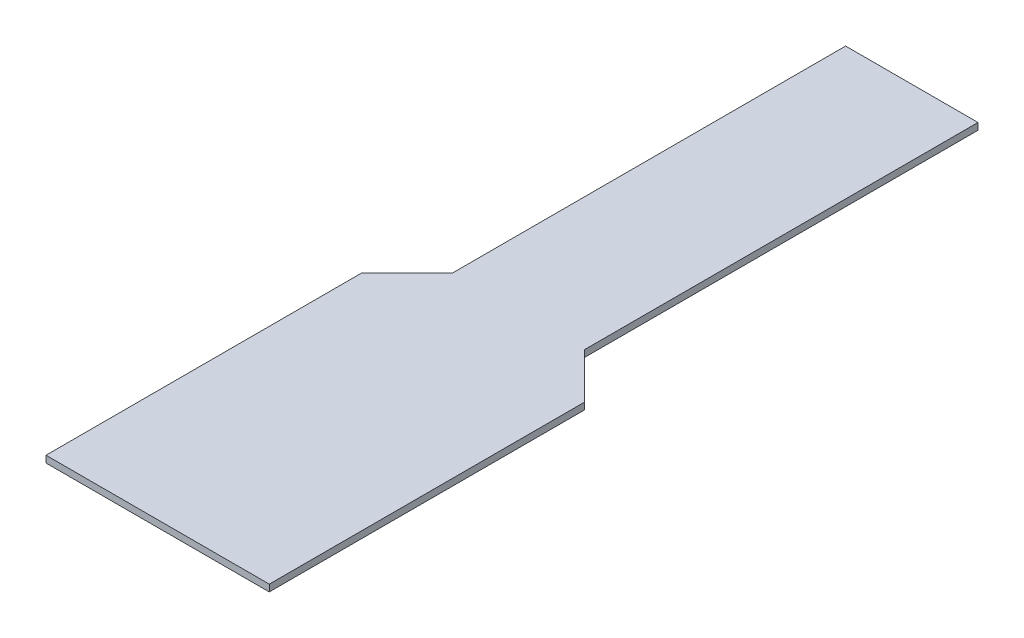
ISO-10303-21;
HEADER;
FILE_DESCRIPTION(('STEP AP214'),'2;1');
FILE_NAME('part.step','',(''),(''),'','','');
FILE_SCHEMA(('AUTOMOTIVE_DESIGN { 1 0 10303 214 1 1 1 1 }'));
ENDSEC;
DATA;
#1=APPLICATION_CONTEXT('core data for automotive mechanical design processes');
#2=APPLICATION_PROTOCOL_DEFINITION('international standard','automotive_design',2000,#1);
#3=PRODUCT_CONTEXT('',#1,'mechanical');
#4=PRODUCT('Part','Part','',(#3));
#5=PRODUCT_RELATED_PRODUCT_CATEGORY('part','',(#4));
#6=PRODUCT_DEFINITION_FORMATION('','',#4);
#7=PRODUCT_DEFINITION_CONTEXT('part definition',#1,'design');
#8=PRODUCT_DEFINITION('design','',#6,#7);
#9=PRODUCT_DEFINITION_SHAPE('','',#8);
#10=(LENGTH_UNIT() NAMED_UNIT(*) SI_UNIT(.MILLI.,.METRE.));
#11=(NAMED_UNIT(*) PLANE_ANGLE_UNIT() SI_UNIT($,.RADIAN.));
#12=(NAMED_UNIT(*) SI_UNIT($,.STERADIAN.) SOLID_ANGLE_UNIT());
#13=UNCERTAINTY_MEASURE_WITH_UNIT(LENGTH_MEASURE(1.E-05),#10,'distance_accuracy_value','');
#14=(GEOMETRIC_REPRESENTATION_CONTEXT(3) GLOBAL_UNCERTAINTY_ASSIGNED_CONTEXT((#13)) GLOBAL_UNIT_ASSIGNED_CONTEXT((#10,
#11,#12)) REPRESENTATION_CONTEXT('',''));
#15=CARTESIAN_POINT('',(0.,0.,0.));
#16=DIRECTION('',(0.,0.,1.));
#17=DIRECTION('',(1.,0.,0.));
#18=AXIS2_PLACEMENT_3D('',#15,#16,#17);
#19=CARTESIAN_POINT('',(-10.4521,0.635,41.0845));
#20=DIRECTION('',(1.,0.,0.));
#21=DIRECTION('',(0.,0.,-1.));
#22=AXIS2_PLACEMENT_3D('',#19,#20,#21);
#23=PLANE('',#22);
#24=DIRECTION('',(0.,0.,1.));
#25=VECTOR('',#24,1.);
#26=CARTESIAN_POINT('',(-10.4521,0.,41.0845));
#27=LINE('',#26,#25);
#28=CARTESIAN_POINT('',(-10.4521,0.,41.0845));
#29=VERTEX_POINT('',#28);
#30=CARTESIAN_POINT('',(-10.4521,0.,70.612));
#31=VERTEX_POINT('',#30);
#32=EDGE_CURVE('E128',#29,#31,#27,.T.);
#33=ORIENTED_EDGE('',*,*,#32,.T.);
#34=DIRECTION('',(0.,-1.,0.));
#35=VECTOR('',#34,1.);
#36=CARTESIAN_POINT('',(-10.4521,0.635,70.612));
#37=LINE('',#36,#35);
#38=CARTESIAN_POINT('',(-10.4521,0.635,70.612));
#39=VERTEX_POINT('',#38);
#40=EDGE_CURVE('E11',#39,#31,#37,.T.);
#41=ORIENTED_EDGE('',*,*,#40,.F.);
#42=DIRECTION('',(0.,0.,1.));
#43=VECTOR('',#42,1.);
#44=CARTESIAN_POINT('',(-10.4521,0.635,41.0845));
#45=LINE('',#44,#43);
#46=CARTESIAN_POINT('',(-10.4521,0.635,41.0845));
#47=VERTEX_POINT('',#46);
#48=EDGE_CURVE('E142',#47,#39,#45,.T.);
#49=ORIENTED_EDGE('',*,*,#48,.F.);
#50=DIRECTION('',(0.,-1.,0.));
#51=VECTOR('',#50,1.);
#52=CARTESIAN_POINT('',(-10.4521,0.635,41.0845));
#53=LINE('',#52,#51);
#54=EDGE_CURVE('E124',#47,#29,#53,.T.);
#55=ORIENTED_EDGE('',*,*,#54,.T.);
#56=EDGE_LOOP('',(#33,#41,#49,#55));
#57=FACE_BOUND('',#56,.T.);
#58=ADVANCED_FACE('F32',(#57),#23,.F.);
#59=CARTESIAN_POINT('',(10.4521,0.635,70.612));
#60=DIRECTION('',(0.,0.,-1.));
#61=DIRECTION('',(-1.,0.,0.));
#62=AXIS2_PLACEMENT_3D('',#59,#60,#61);
#63=PLANE('',#62);
#64=DIRECTION('',(1.,0.,0.));
#65=VECTOR('',#64,1.);
#66=CARTESIAN_POINT('',(10.4521,0.,70.612));
#67=LINE('',#66,#65);
#68=CARTESIAN_POINT('',(10.4521,0.,70.612));
#69=VERTEX_POINT('',#68);
#70=EDGE_CURVE('E131',#31,#69,#67,.T.);
#71=ORIENTED_EDGE('',*,*,#70,.T.);
#72=DIRECTION('',(0.,-1.,0.));
#73=VECTOR('',#72,1.);
#74=CARTESIAN_POINT('',(10.4521,0.635,70.612));
#75=LINE('',#74,#73);
#76=CARTESIAN_POINT('',(10.4521,0.635,70.612));
#77=VERTEX_POINT('',#76);
#78=EDGE_CURVE('E40',#77,#69,#75,.T.);
#79=ORIENTED_EDGE('',*,*,#78,.F.);
#80=DIRECTION('',(1.,0.,0.));
#81=VECTOR('',#80,1.);
#82=CARTESIAN_POINT('',(10.4521,0.635,70.612));
#83=LINE('',#82,#81);
#84=EDGE_CURVE('E91',#39,#77,#83,.T.);
#85=ORIENTED_EDGE('',*,*,#84,.F.);
#86=ORIENTED_EDGE('',*,*,#40,.T.);
#87=EDGE_LOOP('',(#71,#79,#85,#86));
#88=FACE_BOUND('',#87,.T.);
#89=ADVANCED_FACE('F177',(#88),#63,.F.);
#90=CARTESIAN_POINT('',(10.4521,0.635,41.0845));
#91=DIRECTION('',(-1.,0.,0.));
#92=DIRECTION('',(0.,0.,1.));
#93=AXIS2_PLACEMENT_3D('',#90,#91,#92);
#94=PLANE('',#93);
#95=DIRECTION('',(0.,0.,-1.));
#96=VECTOR('',#95,1.);
#97=CARTESIAN_POINT('',(10.4521,0.,41.0845));
#98=LINE('',#97,#96);
#99=CARTESIAN_POINT('',(10.4521,0.,41.0845));
#100=VERTEX_POINT('',#99);
#101=EDGE_CURVE('E133',#69,#100,#98,.T.);
#102=ORIENTED_EDGE('',*,*,#101,.T.);
#103=DIRECTION('',(0.,-1.,0.));
#104=VECTOR('',#103,1.);
#105=CARTESIAN_POINT('',(10.4521,0.635,41.0845));
#106=LINE('',#105,#104);
#107=CARTESIAN_POINT('',(10.4521,0.635,41.0845));
#108=VERTEX_POINT('',#107);
#109=EDGE_CURVE('E149',#108,#100,#106,.T.);
#110=ORIENTED_EDGE('',*,*,#109,.F.);
#111=DIRECTION('',(0.,0.,-1.));
#112=VECTOR('',#111,1.);
#113=CARTESIAN_POINT('',(10.4521,0.635,41.0845));
#114=LINE('',#113,#112);
#115=EDGE_CURVE('E157',#77,#108,#114,.T.);
#116=ORIENTED_EDGE('',*,*,#115,.F.);
#117=ORIENTED_EDGE('',*,*,#78,.T.);
#118=EDGE_LOOP('',(#102,#110,#116,#117));
#119=FACE_BOUND('',#118,.T.);
#120=ADVANCED_FACE('F155',(#119),#94,.F.);
#121=CARTESIAN_POINT('',(6.1976,0.635,36.83));
#122=DIRECTION('',(-0.707106781186546,0.,0.707106781186549));
#123=DIRECTION('',(0.707106781186549,0.,0.707106781186546));
#124=AXIS2_PLACEMENT_3D('',#121,#122,#123);
#125=PLANE('',#124);
#126=DIRECTION('',(-0.707106781186549,0.,-0.707106781186546));
#127=VECTOR('',#126,1.);
#128=CARTESIAN_POINT('',(6.1976,0.,36.83));
#129=LINE('',#128,#127);
#130=CARTESIAN_POINT('',(6.1976,0.,36.83));
#131=VERTEX_POINT('',#130);
#132=EDGE_CURVE('E135',#100,#131,#129,.T.);
#133=ORIENTED_EDGE('',*,*,#132,.T.);
#134=DIRECTION('',(0.,-1.,0.));
#135=VECTOR('',#134,1.);
#136=CARTESIAN_POINT('',(6.1976,0.635,36.83));
#137=LINE('',#136,#135);
#138=CARTESIAN_POINT('',(6.1976,0.635,36.83));
#139=VERTEX_POINT('',#138);
#140=EDGE_CURVE('E146',#139,#131,#137,.T.);
#141=ORIENTED_EDGE('',*,*,#140,.F.);
#142=DIRECTION('',(-0.707106781186549,0.,-0.707106781186546));
#143=VECTOR('',#142,1.);
#144=CARTESIAN_POINT('',(6.1976,0.635,36.83));
#145=LINE('',#144,#143);
#146=EDGE_CURVE('E169',#108,#139,#145,.T.);
#147=ORIENTED_EDGE('',*,*,#146,.F.);
#148=ORIENTED_EDGE('',*,*,#109,.T.);
#149=EDGE_LOOP('',(#133,#141,#147,#148));
#150=FACE_BOUND('',#149,.T.);
#151=ADVANCED_FACE('F165',(#150),#125,.F.);
#152=CARTESIAN_POINT('',(6.1976,0.635,0.));
#153=DIRECTION('',(-1.,0.,0.));
#154=DIRECTION('',(0.,0.,1.));
#155=AXIS2_PLACEMENT_3D('',#152,#153,#154);
#156=PLANE('',#155);
#157=DIRECTION('',(0.,0.,-1.));
#158=VECTOR('',#157,1.);
#159=CARTESIAN_POINT('',(6.1976,0.,0.));
#160=LINE('',#159,#158);
#161=CARTESIAN_POINT('',(6.1976,0.,0.));
#162=VERTEX_POINT('',#161);
#163=EDGE_CURVE('E137',#131,#162,#160,.T.);
#164=ORIENTED_EDGE('',*,*,#163,.T.);
#165=DIRECTION('',(0.,-1.,0.));
#166=VECTOR('',#165,1.);
#167=CARTESIAN_POINT('',(6.1976,0.635,0.));
#168=LINE('',#167,#166);
#169=CARTESIAN_POINT('',(6.1976,0.635,0.));
#170=VERTEX_POINT('',#169);
#171=EDGE_CURVE('E119',#170,#162,#168,.T.);
#172=ORIENTED_EDGE('',*,*,#171,.F.);
#173=DIRECTION('',(0.,0.,-1.));
#174=VECTOR('',#173,1.);
#175=CARTESIAN_POINT('',(6.1976,0.635,0.));
#176=LINE('',#175,#174);
#177=EDGE_CURVE('E110',#139,#170,#176,.T.);
#178=ORIENTED_EDGE('',*,*,#177,.F.);
#179=ORIENTED_EDGE('',*,*,#140,.T.);
#180=EDGE_LOOP('',(#164,#172,#178,#179));
#181=FACE_BOUND('',#180,.T.);
#182=ADVANCED_FACE('F168',(#181),#156,.F.);
#183=CARTESIAN_POINT('',(-6.1976,0.635,0.));
#184=DIRECTION('',(0.,0.,1.));
#185=DIRECTION('',(1.,0.,0.));
#186=AXIS2_PLACEMENT_3D('',#183,#184,#185);
#187=PLANE('',#186);
#188=DIRECTION('',(-1.,0.,0.));
#189=VECTOR('',#188,1.);
#190=CARTESIAN_POINT('',(-6.1976,0.,0.));
#191=LINE('',#190,#189);
#192=CARTESIAN_POINT('',(-6.1976,0.,0.));
#193=VERTEX_POINT('',#192);
#194=EDGE_CURVE('E118',#162,#193,#191,.T.);
#195=ORIENTED_EDGE('',*,*,#194,.T.);
#196=DIRECTION('',(0.,-1.,0.));
#197=VECTOR('',#196,1.);
#198=CARTESIAN_POINT('',(-6.1976,0.635,0.));
#199=LINE('',#198,#197);
#200=CARTESIAN_POINT('',(-6.1976,0.635,0.));
#201=VERTEX_POINT('',#200);
#202=EDGE_CURVE('E115',#201,#193,#199,.T.);
#203=ORIENTED_EDGE('',*,*,#202,.F.);
#204=DIRECTION('',(-1.,0.,0.));
#205=VECTOR('',#204,1.);
#206=CARTESIAN_POINT('',(-6.1976,0.635,0.));
#207=LINE('',#206,#205);
#208=EDGE_CURVE('E104',#170,#201,#207,.T.);
#209=ORIENTED_EDGE('',*,*,#208,.F.);
#210=ORIENTED_EDGE('',*,*,#171,.T.);
#211=EDGE_LOOP('',(#195,#203,#209,#210));
#212=FACE_BOUND('',#211,.T.);
#213=ADVANCED_FACE('F116',(#212),#187,.F.);
#214=CARTESIAN_POINT('',(-6.1976,0.635,0.));
#215=DIRECTION('',(1.,0.,0.));
#216=DIRECTION('',(0.,0.,-1.));
#217=AXIS2_PLACEMENT_3D('',#214,#215,#216);
#218=PLANE('',#217);
#219=DIRECTION('',(0.,0.,1.));
#220=VECTOR('',#219,1.);
#221=CARTESIAN_POINT('',(-6.1976,0.,0.));
#222=LINE('',#221,#220);
#223=CARTESIAN_POINT('',(-6.1976,0.,36.83));
#224=VERTEX_POINT('',#223);
#225=EDGE_CURVE('E77',#193,#224,#222,.T.);
#226=ORIENTED_EDGE('',*,*,#225,.T.);
#227=DIRECTION('',(0.,-1.,0.));
#228=VECTOR('',#227,1.);
#229=CARTESIAN_POINT('',(-6.1976,0.635,36.83));
#230=LINE('',#229,#228);
#231=CARTESIAN_POINT('',(-6.1976,0.635,36.83));
#232=VERTEX_POINT('',#231);
#233=EDGE_CURVE('E120',#232,#224,#230,.T.);
#234=ORIENTED_EDGE('',*,*,#233,.F.);
#235=DIRECTION('',(0.,0.,1.));
#236=VECTOR('',#235,1.);
#237=CARTESIAN_POINT('',(-6.1976,0.635,0.));
#238=LINE('',#237,#236);
#239=EDGE_CURVE('E108',#201,#232,#238,.T.);
#240=ORIENTED_EDGE('',*,*,#239,.F.);
#241=ORIENTED_EDGE('',*,*,#202,.T.);
#242=EDGE_LOOP('',(#226,#234,#240,#241));
#243=FACE_BOUND('',#242,.T.);
#244=ADVANCED_FACE('F122',(#243),#218,.F.);
#245=CARTESIAN_POINT('',(-6.1976,0.635,36.83));
#246=DIRECTION('',(0.707106781186546,0.,0.707106781186549));
#247=DIRECTION('',(0.707106781186549,0.,-0.707106781186546));
#248=AXIS2_PLACEMENT_3D('',#245,#246,#247);
#249=PLANE('',#248);
#250=DIRECTION('',(-0.707106781186549,0.,0.707106781186546));
#251=VECTOR('',#250,1.);
#252=CARTESIAN_POINT('',(-6.1976,0.,36.83));
#253=LINE('',#252,#251);
#254=EDGE_CURVE('E83',#224,#29,#253,.T.);
#255=ORIENTED_EDGE('',*,*,#254,.T.);
#256=ORIENTED_EDGE('',*,*,#54,.F.);
#257=DIRECTION('',(-0.707106781186549,0.,0.707106781186546));
#258=VECTOR('',#257,1.);
#259=CARTESIAN_POINT('',(-6.1976,0.635,36.83));
#260=LINE('',#259,#258);
#261=EDGE_CURVE('E48',#232,#47,#260,.T.);
#262=ORIENTED_EDGE('',*,*,#261,.F.);
#263=ORIENTED_EDGE('',*,*,#233,.T.);
#264=EDGE_LOOP('',(#255,#256,#262,#263));
#265=FACE_BOUND('',#264,.T.);
#266=ADVANCED_FACE('F193',(#265),#249,.F.);
#267=CARTESIAN_POINT('',(0.,0.635,0.));
#268=DIRECTION('',(0.,-1.,0.));
#269=DIRECTION('',(0.,0.,-1.));
#270=AXIS2_PLACEMENT_3D('',#267,#268,#269);
#271=PLANE('',#270);
#272=ORIENTED_EDGE('',*,*,#48,.T.);
#273=ORIENTED_EDGE('',*,*,#84,.T.);
#274=ORIENTED_EDGE('',*,*,#115,.T.);
#275=ORIENTED_EDGE('',*,*,#146,.T.);
#276=ORIENTED_EDGE('',*,*,#177,.T.);
#277=ORIENTED_EDGE('',*,*,#208,.T.);
#278=ORIENTED_EDGE('',*,*,#239,.T.);
#279=ORIENTED_EDGE('',*,*,#261,.T.);
#280=EDGE_LOOP('',(#272,#273,#274,#275,#276,#277,#278,#279));
#281=FACE_BOUND('',#280,.T.);
#282=ADVANCED_FACE('F106',(#281),#271,.F.);
#283=CARTESIAN_POINT('',(0.,0.,0.));
#284=DIRECTION('',(0.,-1.,0.));
#285=DIRECTION('',(0.,0.,-1.));
#286=AXIS2_PLACEMENT_3D('',#283,#284,#285);
#287=PLANE('',#286);
#288=ORIENTED_EDGE('',*,*,#32,.F.);
#289=ORIENTED_EDGE('',*,*,#254,.F.);
#290=ORIENTED_EDGE('',*,*,#225,.F.);
#291=ORIENTED_EDGE('',*,*,#194,.F.);
#292=ORIENTED_EDGE('',*,*,#163,.F.);
#293=ORIENTED_EDGE('',*,*,#132,.F.);
#294=ORIENTED_EDGE('',*,*,#101,.F.);
#295=ORIENTED_EDGE('',*,*,#70,.F.);
#296=EDGE_LOOP('',(#288,#289,#290,#291,#292,#293,#294,#295));
#297=FACE_BOUND('',#296,.T.);
#298=ADVANCED_FACE('F161',(#297),#287,.T.);
#299=CLOSED_SHELL('',(#58,#89,#120,#151,#182,#213,#244,#266,#282,#298));
#300=MANIFOLD_SOLID_BREP('B2',#299);
#301=ADVANCED_BREP_SHAPE_REPRESENTATION('',(#18,#300),#14);
#302=SHAPE_DEFINITION_REPRESENTATION(#9,#301);
ENDSEC;
END-ISO-10303-21;
